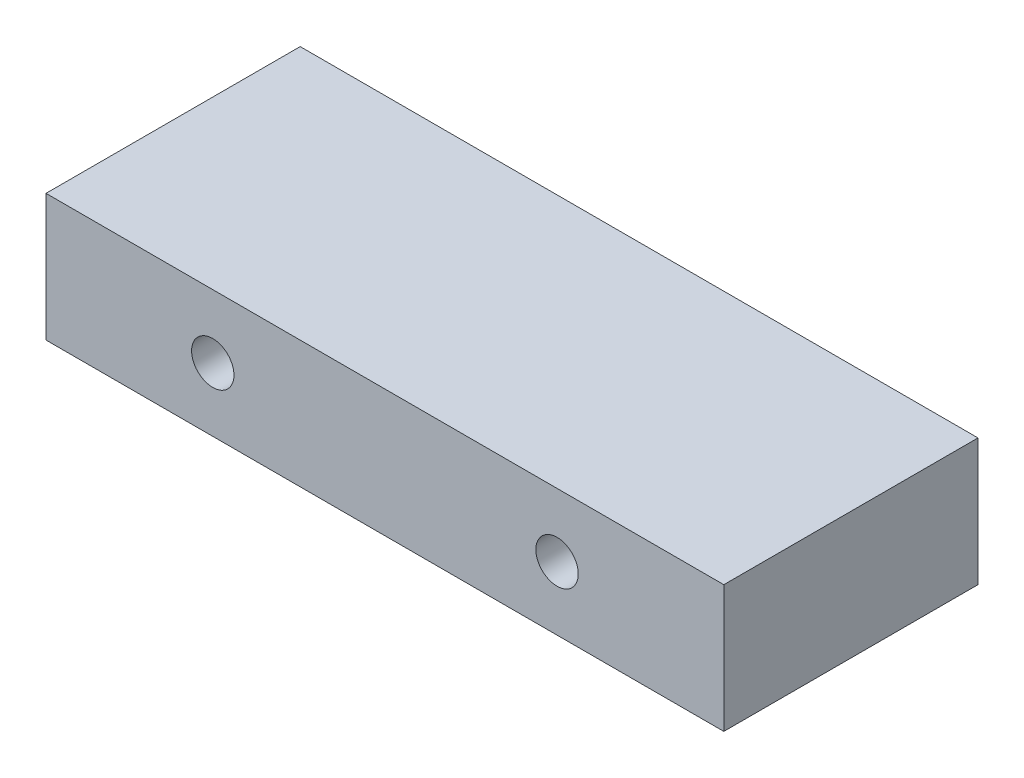
ISO-10303-21;
HEADER;
FILE_DESCRIPTION(('STEP AP214'),'2;1');
FILE_NAME('part.step','',(''),(''),'','','');
FILE_SCHEMA(('AUTOMOTIVE_DESIGN { 1 0 10303 214 1 1 1 1 }'));
ENDSEC;
DATA;
#1=APPLICATION_CONTEXT('core data for automotive mechanical design processes');
#2=APPLICATION_PROTOCOL_DEFINITION('international standard','automotive_design',2000,#1);
#3=PRODUCT_CONTEXT('',#1,'mechanical');
#4=PRODUCT('Part','Part','',(#3));
#5=PRODUCT_RELATED_PRODUCT_CATEGORY('part','',(#4));
#6=PRODUCT_DEFINITION_FORMATION('','',#4);
#7=PRODUCT_DEFINITION_CONTEXT('part definition',#1,'design');
#8=PRODUCT_DEFINITION('design','',#6,#7);
#9=PRODUCT_DEFINITION_SHAPE('','',#8);
#10=(LENGTH_UNIT() NAMED_UNIT(*) SI_UNIT(.MILLI.,.METRE.));
#11=(NAMED_UNIT(*) PLANE_ANGLE_UNIT() SI_UNIT($,.RADIAN.));
#12=(NAMED_UNIT(*) SI_UNIT($,.STERADIAN.) SOLID_ANGLE_UNIT());
#13=UNCERTAINTY_MEASURE_WITH_UNIT(LENGTH_MEASURE(1.E-05),#10,'distance_accuracy_value','');
#14=(GEOMETRIC_REPRESENTATION_CONTEXT(3) GLOBAL_UNCERTAINTY_ASSIGNED_CONTEXT((#13)) GLOBAL_UNIT_ASSIGNED_CONTEXT((#10,
#11,#12)) REPRESENTATION_CONTEXT('',''));
#15=CARTESIAN_POINT('',(0.,0.,0.));
#16=DIRECTION('',(0.,0.,1.));
#17=DIRECTION('',(1.,0.,0.));
#18=AXIS2_PLACEMENT_3D('',#15,#16,#17);
#19=CARTESIAN_POINT('',(0.,0.,38.1));
#20=DIRECTION('',(0.,1.,0.));
#21=DIRECTION('',(0.,0.,1.));
#22=AXIS2_PLACEMENT_3D('',#19,#20,#21);
#23=PLANE('',#22);
#24=DIRECTION('',(1.,0.,0.));
#25=VECTOR('',#24,1.);
#26=CARTESIAN_POINT('',(0.,0.,0.));
#27=LINE('',#26,#25);
#28=CARTESIAN_POINT('',(0.,0.,0.));
#29=VERTEX_POINT('',#28);
#30=CARTESIAN_POINT('',(101.6,0.,0.));
#31=VERTEX_POINT('',#30);
#32=EDGE_CURVE('E107',#29,#31,#27,.T.);
#33=ORIENTED_EDGE('',*,*,#32,.T.);
#34=DIRECTION('',(0.,0.,-1.));
#35=VECTOR('',#34,1.);
#36=CARTESIAN_POINT('',(101.6,0.,38.1));
#37=LINE('',#36,#35);
#38=CARTESIAN_POINT('',(101.6,0.,38.1));
#39=VERTEX_POINT('',#38);
#40=EDGE_CURVE('E11',#39,#31,#37,.T.);
#41=ORIENTED_EDGE('',*,*,#40,.F.);
#42=DIRECTION('',(1.,0.,0.));
#43=VECTOR('',#42,1.);
#44=CARTESIAN_POINT('',(0.,0.,38.1));
#45=LINE('',#44,#43);
#46=CARTESIAN_POINT('',(0.,0.,38.1));
#47=VERTEX_POINT('',#46);
#48=EDGE_CURVE('E89',#47,#39,#45,.T.);
#49=ORIENTED_EDGE('',*,*,#48,.F.);
#50=DIRECTION('',(0.,0.,-1.));
#51=VECTOR('',#50,1.);
#52=CARTESIAN_POINT('',(0.,0.,38.1));
#53=LINE('',#52,#51);
#54=EDGE_CURVE('E97',#47,#29,#53,.T.);
#55=ORIENTED_EDGE('',*,*,#54,.T.);
#56=EDGE_LOOP('',(#33,#41,#49,#55));
#57=FACE_BOUND('',#56,.T.);
#58=ADVANCED_FACE('F37',(#57),#23,.F.);
#59=CARTESIAN_POINT('',(101.6,0.,38.1));
#60=DIRECTION('',(-1.,0.,0.));
#61=DIRECTION('',(0.,0.,1.));
#62=AXIS2_PLACEMENT_3D('',#59,#60,#61);
#63=PLANE('',#62);
#64=DIRECTION('',(0.,1.,0.));
#65=VECTOR('',#64,1.);
#66=CARTESIAN_POINT('',(101.6,0.,0.));
#67=LINE('',#66,#65);
#68=CARTESIAN_POINT('',(101.6,19.05,0.));
#69=VERTEX_POINT('',#68);
#70=EDGE_CURVE('E93',#31,#69,#67,.T.);
#71=ORIENTED_EDGE('',*,*,#70,.T.);
#72=DIRECTION('',(0.,0.,-1.));
#73=VECTOR('',#72,1.);
#74=CARTESIAN_POINT('',(101.6,19.05,38.1));
#75=LINE('',#74,#73);
#76=CARTESIAN_POINT('',(101.6,19.05,38.1));
#77=VERTEX_POINT('',#76);
#78=EDGE_CURVE('E46',#77,#69,#75,.T.);
#79=ORIENTED_EDGE('',*,*,#78,.F.);
#80=DIRECTION('',(0.,1.,0.));
#81=VECTOR('',#80,1.);
#82=CARTESIAN_POINT('',(101.6,0.,38.1));
#83=LINE('',#82,#81);
#84=EDGE_CURVE('E84',#39,#77,#83,.T.);
#85=ORIENTED_EDGE('',*,*,#84,.F.);
#86=ORIENTED_EDGE('',*,*,#40,.T.);
#87=EDGE_LOOP('',(#71,#79,#85,#86));
#88=FACE_BOUND('',#87,.T.);
#89=ADVANCED_FACE('F92',(#88),#63,.F.);
#90=CARTESIAN_POINT('',(0.,19.05,38.1));
#91=DIRECTION('',(0.,-1.,0.));
#92=DIRECTION('',(0.,0.,-1.));
#93=AXIS2_PLACEMENT_3D('',#90,#91,#92);
#94=PLANE('',#93);
#95=DIRECTION('',(-1.,0.,0.));
#96=VECTOR('',#95,1.);
#97=CARTESIAN_POINT('',(0.,19.05,0.));
#98=LINE('',#97,#96);
#99=CARTESIAN_POINT('',(0.,19.05,0.));
#100=VERTEX_POINT('',#99);
#101=EDGE_CURVE('E71',#69,#100,#98,.T.);
#102=ORIENTED_EDGE('',*,*,#101,.T.);
#103=DIRECTION('',(0.,0.,-1.));
#104=VECTOR('',#103,1.);
#105=CARTESIAN_POINT('',(0.,19.05,38.1));
#106=LINE('',#105,#104);
#107=CARTESIAN_POINT('',(0.,19.05,38.1));
#108=VERTEX_POINT('',#107);
#109=EDGE_CURVE('E94',#108,#100,#106,.T.);
#110=ORIENTED_EDGE('',*,*,#109,.F.);
#111=DIRECTION('',(-1.,0.,0.));
#112=VECTOR('',#111,1.);
#113=CARTESIAN_POINT('',(0.,19.05,38.1));
#114=LINE('',#113,#112);
#115=EDGE_CURVE('E87',#77,#108,#114,.T.);
#116=ORIENTED_EDGE('',*,*,#115,.F.);
#117=ORIENTED_EDGE('',*,*,#78,.T.);
#118=EDGE_LOOP('',(#102,#110,#116,#117));
#119=FACE_BOUND('',#118,.T.);
#120=ADVANCED_FACE('F95',(#119),#94,.F.);
#121=CARTESIAN_POINT('',(24.9970729463759,9.525,38.1));
#122=DIRECTION('',(0.,0.,-1.));
#123=DIRECTION('',(-1.,0.,0.));
#124=AXIS2_PLACEMENT_3D('',#121,#122,#123);
#125=CYLINDRICAL_SURFACE('',#124,3.175);
#126=CARTESIAN_POINT('',(24.9970729463759,9.525,38.1));
#127=DIRECTION('',(0.,0.,1.));
#128=DIRECTION('',(1.,0.,0.));
#129=AXIS2_PLACEMENT_3D('',#126,#127,#128);
#130=CIRCLE('',#129,3.175);
#131=CARTESIAN_POINT('',(28.1720729463759,9.525,38.1));
#132=VERTEX_POINT('',#131);
#133=EDGE_CURVE('E120',#132,#132,#130,.T.);
#134=ORIENTED_EDGE('',*,*,#133,.T.);
#135=EDGE_LOOP('',(#134));
#136=FACE_BOUND('',#135,.T.);
#137=CARTESIAN_POINT('',(24.9970729463759,9.525,0.));
#138=DIRECTION('',(0.,0.,1.));
#139=DIRECTION('',(1.,0.,0.));
#140=AXIS2_PLACEMENT_3D('',#137,#138,#139);
#141=CIRCLE('',#140,3.175);
#142=CARTESIAN_POINT('',(28.1720729463759,9.525,0.));
#143=VERTEX_POINT('',#142);
#144=EDGE_CURVE('E104',#143,#143,#141,.T.);
#145=ORIENTED_EDGE('',*,*,#144,.F.);
#146=EDGE_LOOP('',(#145));
#147=FACE_BOUND('',#146,.T.);
#148=ADVANCED_FACE('F134',(#136,#147),#125,.F.);
#149=CARTESIAN_POINT('',(76.6039208358877,9.525,38.1));
#150=DIRECTION('',(0.,0.,-1.));
#151=DIRECTION('',(-1.,0.,0.));
#152=AXIS2_PLACEMENT_3D('',#149,#150,#151);
#153=CYLINDRICAL_SURFACE('',#152,3.175);
#154=CARTESIAN_POINT('',(76.6039208358877,9.525,38.1));
#155=DIRECTION('',(0.,0.,1.));
#156=DIRECTION('',(1.,0.,0.));
#157=AXIS2_PLACEMENT_3D('',#154,#155,#156);
#158=CIRCLE('',#157,3.175);
#159=CARTESIAN_POINT('',(79.7789208358877,9.525,38.1));
#160=VERTEX_POINT('',#159);
#161=EDGE_CURVE('E113',#160,#160,#158,.T.);
#162=ORIENTED_EDGE('',*,*,#161,.T.);
#163=EDGE_LOOP('',(#162));
#164=FACE_BOUND('',#163,.T.);
#165=CARTESIAN_POINT('',(76.6039208358877,9.525,0.));
#166=DIRECTION('',(0.,0.,1.));
#167=DIRECTION('',(1.,0.,0.));
#168=AXIS2_PLACEMENT_3D('',#165,#166,#167);
#169=CIRCLE('',#168,3.175);
#170=CARTESIAN_POINT('',(79.7789208358877,9.525,0.));
#171=VERTEX_POINT('',#170);
#172=EDGE_CURVE('E101',#171,#171,#169,.T.);
#173=ORIENTED_EDGE('',*,*,#172,.F.);
#174=EDGE_LOOP('',(#173));
#175=FACE_BOUND('',#174,.T.);
#176=ADVANCED_FACE('F39',(#164,#175),#153,.F.);
#177=CARTESIAN_POINT('',(0.,0.,38.1));
#178=DIRECTION('',(1.,0.,0.));
#179=DIRECTION('',(0.,0.,-1.));
#180=AXIS2_PLACEMENT_3D('',#177,#178,#179);
#181=PLANE('',#180);
#182=DIRECTION('',(0.,-1.,0.));
#183=VECTOR('',#182,1.);
#184=CARTESIAN_POINT('',(0.,0.,0.));
#185=LINE('',#184,#183);
#186=EDGE_CURVE('E77',#100,#29,#185,.T.);
#187=ORIENTED_EDGE('',*,*,#186,.T.);
#188=ORIENTED_EDGE('',*,*,#54,.F.);
#189=DIRECTION('',(0.,-1.,0.));
#190=VECTOR('',#189,1.);
#191=CARTESIAN_POINT('',(0.,0.,38.1));
#192=LINE('',#191,#190);
#193=EDGE_CURVE('E54',#108,#47,#192,.T.);
#194=ORIENTED_EDGE('',*,*,#193,.F.);
#195=ORIENTED_EDGE('',*,*,#109,.T.);
#196=EDGE_LOOP('',(#187,#188,#194,#195));
#197=FACE_BOUND('',#196,.T.);
#198=ADVANCED_FACE('F115',(#197),#181,.F.);
#199=CARTESIAN_POINT('',(0.,0.,38.1));
#200=DIRECTION('',(0.,0.,1.));
#201=DIRECTION('',(1.,0.,0.));
#202=AXIS2_PLACEMENT_3D('',#199,#200,#201);
#203=PLANE('',#202);
#204=ORIENTED_EDGE('',*,*,#161,.F.);
#205=EDGE_LOOP('',(#204));
#206=FACE_BOUND('',#205,.T.);
#207=ORIENTED_EDGE('',*,*,#133,.F.);
#208=EDGE_LOOP('',(#207));
#209=FACE_BOUND('',#208,.T.);
#210=ORIENTED_EDGE('',*,*,#48,.T.);
#211=ORIENTED_EDGE('',*,*,#84,.T.);
#212=ORIENTED_EDGE('',*,*,#115,.T.);
#213=ORIENTED_EDGE('',*,*,#193,.T.);
#214=EDGE_LOOP('',(#210,#211,#212,#213));
#215=FACE_BOUND('',#214,.T.);
#216=ADVANCED_FACE('F85',(#206,#209,#215),#203,.T.);
#217=CARTESIAN_POINT('',(0.,0.,0.));
#218=DIRECTION('',(0.,0.,1.));
#219=DIRECTION('',(1.,0.,0.));
#220=AXIS2_PLACEMENT_3D('',#217,#218,#219);
#221=PLANE('',#220);
#222=ORIENTED_EDGE('',*,*,#172,.T.);
#223=EDGE_LOOP('',(#222));
#224=FACE_BOUND('',#223,.T.);
#225=ORIENTED_EDGE('',*,*,#144,.T.);
#226=EDGE_LOOP('',(#225));
#227=FACE_BOUND('',#226,.T.);
#228=ORIENTED_EDGE('',*,*,#32,.F.);
#229=ORIENTED_EDGE('',*,*,#186,.F.);
#230=ORIENTED_EDGE('',*,*,#101,.F.);
#231=ORIENTED_EDGE('',*,*,#70,.F.);
#232=EDGE_LOOP('',(#228,#229,#230,#231));
#233=FACE_BOUND('',#232,.T.);
#234=ADVANCED_FACE('F118',(#224,#227,#233),#221,.F.);
#235=CLOSED_SHELL('',(#58,#89,#120,#148,#176,#198,#216,#234));
#236=MANIFOLD_SOLID_BREP('B2',#235);
#237=ADVANCED_BREP_SHAPE_REPRESENTATION('',(#18,#236),#14);
#238=SHAPE_DEFINITION_REPRESENTATION(#9,#237);
ENDSEC;
END-ISO-10303-21;
